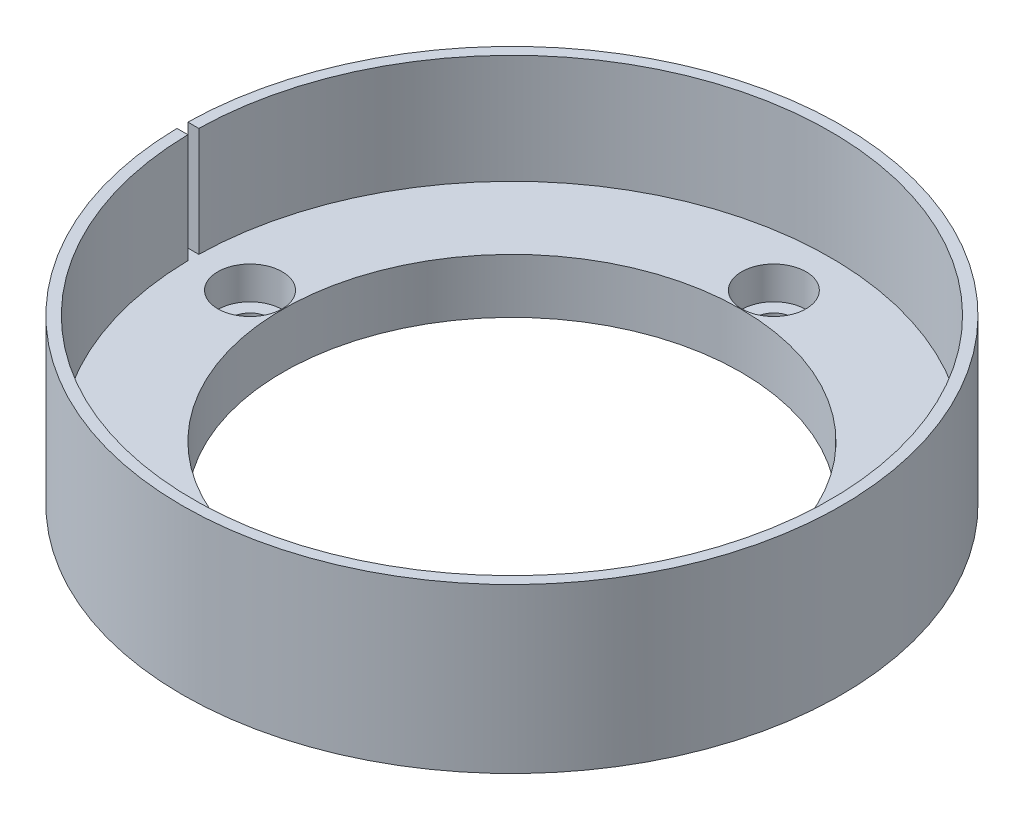
ISO-10303-21;
HEADER;
FILE_DESCRIPTION(('STEP AP214'),'2;1');
FILE_NAME('part.step','',(''),(''),'','','');
FILE_SCHEMA(('AUTOMOTIVE_DESIGN { 1 0 10303 214 1 1 1 1 }'));
ENDSEC;
DATA;
#1=APPLICATION_CONTEXT('core data for automotive mechanical design processes');
#2=APPLICATION_PROTOCOL_DEFINITION('international standard','automotive_design',2000,#1);
#3=PRODUCT_CONTEXT('',#1,'mechanical');
#4=PRODUCT('Part','Part','',(#3));
#5=PRODUCT_RELATED_PRODUCT_CATEGORY('part','',(#4));
#6=PRODUCT_DEFINITION_FORMATION('','',#4);
#7=PRODUCT_DEFINITION_CONTEXT('part definition',#1,'design');
#8=PRODUCT_DEFINITION('design','',#6,#7);
#9=PRODUCT_DEFINITION_SHAPE('','',#8);
#10=(LENGTH_UNIT() NAMED_UNIT(*) SI_UNIT(.MILLI.,.METRE.));
#11=(NAMED_UNIT(*) PLANE_ANGLE_UNIT() SI_UNIT($,.RADIAN.));
#12=(NAMED_UNIT(*) SI_UNIT($,.STERADIAN.) SOLID_ANGLE_UNIT());
#13=UNCERTAINTY_MEASURE_WITH_UNIT(LENGTH_MEASURE(1.E-05),#10,'distance_accuracy_value','');
#14=(GEOMETRIC_REPRESENTATION_CONTEXT(3) GLOBAL_UNCERTAINTY_ASSIGNED_CONTEXT((#13)) GLOBAL_UNIT_ASSIGNED_CONTEXT((#10,
#11,#12)) REPRESENTATION_CONTEXT('',''));
#15=CARTESIAN_POINT('',(0.,0.,0.));
#16=DIRECTION('',(0.,0.,1.));
#17=DIRECTION('',(1.,0.,0.));
#18=AXIS2_PLACEMENT_3D('',#15,#16,#17);
#19=CARTESIAN_POINT('',(0.,-5.,24.));
#20=DIRECTION('',(0.,1.,0.));
#21=DIRECTION('',(0.,0.,1.));
#22=AXIS2_PLACEMENT_3D('',#19,#20,#21);
#23=CYLINDRICAL_SURFACE('',#22,1.7);
#24=CARTESIAN_POINT('',(0.,0.,24.));
#25=DIRECTION('',(0.,1.,0.));
#26=DIRECTION('',(0.,0.,1.));
#27=AXIS2_PLACEMENT_3D('',#24,#25,#26);
#28=CIRCLE('',#27,1.7);
#29=CARTESIAN_POINT('',(0.,0.,25.7));
#30=VERTEX_POINT('',#29);
#31=EDGE_CURVE('E132',#30,#30,#28,.T.);
#32=ORIENTED_EDGE('',*,*,#31,.F.);
#33=EDGE_LOOP('',(#32));
#34=FACE_BOUND('',#33,.T.);
#35=CARTESIAN_POINT('',(0.,2.,24.));
#36=DIRECTION('',(0.,1.,0.));
#37=DIRECTION('',(0.,0.,1.));
#38=AXIS2_PLACEMENT_3D('',#35,#36,#37);
#39=CIRCLE('',#38,1.7);
#40=CARTESIAN_POINT('',(0.,2.,25.7));
#41=VERTEX_POINT('',#40);
#42=EDGE_CURVE('E129',#41,#41,#39,.F.);
#43=ORIENTED_EDGE('',*,*,#42,.F.);
#44=EDGE_LOOP('',(#43));
#45=FACE_BOUND('',#44,.T.);
#46=ADVANCED_FACE('F39',(#34,#45),#23,.F.);
#47=CARTESIAN_POINT('',(24.,-5.,0.));
#48=DIRECTION('',(0.,1.,0.));
#49=DIRECTION('',(0.,0.,1.));
#50=AXIS2_PLACEMENT_3D('',#47,#48,#49);
#51=CYLINDRICAL_SURFACE('',#50,1.7);
#52=CARTESIAN_POINT('',(24.,0.,0.));
#53=DIRECTION('',(0.,1.,0.));
#54=DIRECTION('',(0.,0.,1.));
#55=AXIS2_PLACEMENT_3D('',#52,#53,#54);
#56=CIRCLE('',#55,1.7);
#57=CARTESIAN_POINT('',(24.,0.,1.7));
#58=VERTEX_POINT('',#57);
#59=EDGE_CURVE('E189',#58,#58,#56,.T.);
#60=ORIENTED_EDGE('',*,*,#59,.F.);
#61=EDGE_LOOP('',(#60));
#62=FACE_BOUND('',#61,.T.);
#63=CARTESIAN_POINT('',(24.,2.,0.));
#64=DIRECTION('',(0.,1.,0.));
#65=DIRECTION('',(0.,0.,1.));
#66=AXIS2_PLACEMENT_3D('',#63,#64,#65);
#67=CIRCLE('',#66,1.7);
#68=CARTESIAN_POINT('',(24.,2.,1.7));
#69=VERTEX_POINT('',#68);
#70=EDGE_CURVE('E125',#69,#69,#67,.F.);
#71=ORIENTED_EDGE('',*,*,#70,.F.);
#72=EDGE_LOOP('',(#71));
#73=FACE_BOUND('',#72,.T.);
#74=ADVANCED_FACE('F228',(#62,#73),#51,.F.);
#75=CARTESIAN_POINT('',(0.,-5.,-24.));
#76=DIRECTION('',(0.,1.,0.));
#77=DIRECTION('',(0.,0.,1.));
#78=AXIS2_PLACEMENT_3D('',#75,#76,#77);
#79=CYLINDRICAL_SURFACE('',#78,1.7);
#80=CARTESIAN_POINT('',(0.,0.,-24.));
#81=DIRECTION('',(0.,1.,0.));
#82=DIRECTION('',(0.,0.,1.));
#83=AXIS2_PLACEMENT_3D('',#80,#81,#82);
#84=CIRCLE('',#83,1.7);
#85=CARTESIAN_POINT('',(0.,0.,-22.3));
#86=VERTEX_POINT('',#85);
#87=EDGE_CURVE('E193',#86,#86,#84,.T.);
#88=ORIENTED_EDGE('',*,*,#87,.F.);
#89=EDGE_LOOP('',(#88));
#90=FACE_BOUND('',#89,.T.);
#91=CARTESIAN_POINT('',(0.,2.,-24.));
#92=DIRECTION('',(0.,1.,0.));
#93=DIRECTION('',(0.,0.,1.));
#94=AXIS2_PLACEMENT_3D('',#91,#92,#93);
#95=CIRCLE('',#94,1.7);
#96=CARTESIAN_POINT('',(0.,2.,-22.3));
#97=VERTEX_POINT('',#96);
#98=EDGE_CURVE('E120',#97,#97,#95,.F.);
#99=ORIENTED_EDGE('',*,*,#98,.F.);
#100=EDGE_LOOP('',(#99));
#101=FACE_BOUND('',#100,.T.);
#102=ADVANCED_FACE('F234',(#90,#101),#79,.F.);
#103=CARTESIAN_POINT('',(-24.,-5.,0.));
#104=DIRECTION('',(0.,1.,0.));
#105=DIRECTION('',(0.,0.,1.));
#106=AXIS2_PLACEMENT_3D('',#103,#104,#105);
#107=CYLINDRICAL_SURFACE('',#106,1.7);
#108=CARTESIAN_POINT('',(-24.,0.,0.));
#109=DIRECTION('',(0.,1.,0.));
#110=DIRECTION('',(0.,0.,1.));
#111=AXIS2_PLACEMENT_3D('',#108,#109,#110);
#112=CIRCLE('',#111,1.7);
#113=CARTESIAN_POINT('',(-24.,0.,1.7));
#114=VERTEX_POINT('',#113);
#115=EDGE_CURVE('E197',#114,#114,#112,.T.);
#116=ORIENTED_EDGE('',*,*,#115,.F.);
#117=EDGE_LOOP('',(#116));
#118=FACE_BOUND('',#117,.T.);
#119=CARTESIAN_POINT('',(-24.,2.,0.));
#120=DIRECTION('',(0.,1.,0.));
#121=DIRECTION('',(0.,0.,1.));
#122=AXIS2_PLACEMENT_3D('',#119,#120,#121);
#123=CIRCLE('',#122,1.7);
#124=CARTESIAN_POINT('',(-24.,2.,1.7));
#125=VERTEX_POINT('',#124);
#126=EDGE_CURVE('E116',#125,#125,#123,.F.);
#127=ORIENTED_EDGE('',*,*,#126,.F.);
#128=EDGE_LOOP('',(#127));
#129=FACE_BOUND('',#128,.T.);
#130=ADVANCED_FACE('F211',(#118,#129),#107,.F.);
#131=CARTESIAN_POINT('',(30.2,0.,0.));
#132=DIRECTION('',(0.,1.,0.));
#133=DIRECTION('',(0.,0.,1.));
#134=AXIS2_PLACEMENT_3D('',#131,#132,#133);
#135=PLANE('',#134);
#136=ORIENTED_EDGE('',*,*,#115,.T.);
#137=EDGE_LOOP('',(#136));
#138=FACE_BOUND('',#137,.T.);
#139=ORIENTED_EDGE('',*,*,#87,.T.);
#140=EDGE_LOOP('',(#139));
#141=FACE_BOUND('',#140,.T.);
#142=ORIENTED_EDGE('',*,*,#59,.T.);
#143=EDGE_LOOP('',(#142));
#144=FACE_BOUND('',#143,.T.);
#145=ORIENTED_EDGE('',*,*,#31,.T.);
#146=EDGE_LOOP('',(#145));
#147=FACE_BOUND('',#146,.T.);
#148=CARTESIAN_POINT('',(0.,0.,0.));
#149=DIRECTION('',(0.,1.,0.));
#150=DIRECTION('',(0.,0.,1.));
#151=AXIS2_PLACEMENT_3D('',#148,#149,#150);
#152=CIRCLE('',#151,30.2);
#153=CARTESIAN_POINT('',(0.,0.,30.2));
#154=VERTEX_POINT('',#153);
#155=EDGE_CURVE('E201',#154,#154,#152,.T.);
#156=ORIENTED_EDGE('',*,*,#155,.F.);
#157=EDGE_LOOP('',(#156));
#158=FACE_BOUND('',#157,.T.);
#159=CARTESIAN_POINT('',(0.,0.,0.));
#160=DIRECTION('',(0.,1.,0.));
#161=DIRECTION('',(0.,0.,1.));
#162=AXIS2_PLACEMENT_3D('',#159,#160,#161);
#163=CIRCLE('',#162,21.);
#164=CARTESIAN_POINT('',(0.,0.,21.));
#165=VERTEX_POINT('',#164);
#166=EDGE_CURVE('E107',#165,#165,#163,.T.);
#167=ORIENTED_EDGE('',*,*,#166,.T.);
#168=EDGE_LOOP('',(#167));
#169=FACE_BOUND('',#168,.T.);
#170=ADVANCED_FACE('F41',(#138,#141,#144,#147,#158,#169),#135,.F.);
#171=CARTESIAN_POINT('',(0.,26.8169522665698,0.));
#172=DIRECTION('',(0.,1.,0.));
#173=DIRECTION('',(0.,0.,1.));
#174=AXIS2_PLACEMENT_3D('',#171,#172,#173);
#175=CYLINDRICAL_SURFACE('',#174,21.);
#176=ORIENTED_EDGE('',*,*,#166,.F.);
#177=EDGE_LOOP('',(#176));
#178=FACE_BOUND('',#177,.T.);
#179=CARTESIAN_POINT('',(0.,5.,0.));
#180=DIRECTION('',(0.,1.,0.));
#181=DIRECTION('',(0.,0.,1.));
#182=AXIS2_PLACEMENT_3D('',#179,#180,#181);
#183=CIRCLE('',#182,21.);
#184=CARTESIAN_POINT('',(0.,5.,21.));
#185=VERTEX_POINT('',#184);
#186=EDGE_CURVE('E102',#185,#185,#183,.T.);
#187=ORIENTED_EDGE('',*,*,#186,.T.);
#188=EDGE_LOOP('',(#187));
#189=FACE_BOUND('',#188,.T.);
#190=ADVANCED_FACE('F210',(#178,#189),#175,.F.);
#191=CARTESIAN_POINT('',(21.,5.,0.));
#192=DIRECTION('',(0.,-1.,0.));
#193=DIRECTION('',(0.,0.,-1.));
#194=AXIS2_PLACEMENT_3D('',#191,#192,#193);
#195=PLANE('',#194);
#196=CARTESIAN_POINT('',(-24.,5.,0.));
#197=DIRECTION('',(0.,1.,0.));
#198=DIRECTION('',(0.,0.,1.));
#199=AXIS2_PLACEMENT_3D('',#196,#197,#198);
#200=CIRCLE('',#199,2.95);
#201=CARTESIAN_POINT('',(-24.,5.,2.95));
#202=VERTEX_POINT('',#201);
#203=EDGE_CURVE('E159',#202,#202,#200,.T.);
#204=ORIENTED_EDGE('',*,*,#203,.F.);
#205=EDGE_LOOP('',(#204));
#206=FACE_BOUND('',#205,.T.);
#207=CARTESIAN_POINT('',(0.,5.,0.));
#208=DIRECTION('',(0.,1.,0.));
#209=DIRECTION('',(0.,0.,1.));
#210=AXIS2_PLACEMENT_3D('',#207,#208,#209);
#211=CIRCLE('',#210,29.2);
#212=CARTESIAN_POINT('',(-29.1957188642445,5.,0.5));
#213=VERTEX_POINT('',#212);
#214=CARTESIAN_POINT('',(-29.1957188642445,5.,-0.5));
#215=VERTEX_POINT('',#214);
#216=EDGE_CURVE('E90',#213,#215,#211,.T.);
#217=ORIENTED_EDGE('',*,*,#216,.T.);
#218=DIRECTION('',(-1.,0.,0.));
#219=VECTOR('',#218,1.);
#220=CARTESIAN_POINT('',(-24.2,5.,-0.500000000000001));
#221=LINE('',#220,#219);
#222=CARTESIAN_POINT('',(-30.1958606434723,5.,-0.5));
#223=VERTEX_POINT('',#222);
#224=EDGE_CURVE('E55',#215,#223,#221,.T.);
#225=ORIENTED_EDGE('',*,*,#224,.T.);
#226=CARTESIAN_POINT('',(0.,5.,0.));
#227=DIRECTION('',(0.,1.,0.));
#228=DIRECTION('',(0.,0.,1.));
#229=AXIS2_PLACEMENT_3D('',#226,#227,#228);
#230=CIRCLE('',#229,30.2);
#231=CARTESIAN_POINT('',(-30.1958606434723,5.,0.5));
#232=VERTEX_POINT('',#231);
#233=EDGE_CURVE('E82',#223,#232,#230,.T.);
#234=ORIENTED_EDGE('',*,*,#233,.T.);
#235=DIRECTION('',(1.,0.,0.));
#236=VECTOR('',#235,1.);
#237=CARTESIAN_POINT('',(-24.2,5.,0.499999999999999));
#238=LINE('',#237,#236);
#239=EDGE_CURVE('E83',#232,#213,#238,.T.);
#240=ORIENTED_EDGE('',*,*,#239,.T.);
#241=EDGE_LOOP('',(#217,#225,#234,#240));
#242=FACE_BOUND('',#241,.T.);
#243=CARTESIAN_POINT('',(0.,5.,-24.));
#244=DIRECTION('',(0.,1.,0.));
#245=DIRECTION('',(0.,0.,1.));
#246=AXIS2_PLACEMENT_3D('',#243,#244,#245);
#247=CIRCLE('',#246,2.95);
#248=CARTESIAN_POINT('',(0.,5.,-21.05));
#249=VERTEX_POINT('',#248);
#250=EDGE_CURVE('E167',#249,#249,#247,.T.);
#251=ORIENTED_EDGE('',*,*,#250,.F.);
#252=EDGE_LOOP('',(#251));
#253=FACE_BOUND('',#252,.T.);
#254=CARTESIAN_POINT('',(24.,5.,0.));
#255=DIRECTION('',(0.,1.,0.));
#256=DIRECTION('',(0.,0.,1.));
#257=AXIS2_PLACEMENT_3D('',#254,#255,#256);
#258=CIRCLE('',#257,2.95);
#259=CARTESIAN_POINT('',(24.,5.,2.95));
#260=VERTEX_POINT('',#259);
#261=EDGE_CURVE('E175',#260,#260,#258,.T.);
#262=ORIENTED_EDGE('',*,*,#261,.F.);
#263=EDGE_LOOP('',(#262));
#264=FACE_BOUND('',#263,.T.);
#265=CARTESIAN_POINT('',(0.,5.,24.));
#266=DIRECTION('',(0.,1.,0.));
#267=DIRECTION('',(0.,0.,1.));
#268=AXIS2_PLACEMENT_3D('',#265,#266,#267);
#269=CIRCLE('',#268,2.95);
#270=CARTESIAN_POINT('',(0.,5.,26.95));
#271=VERTEX_POINT('',#270);
#272=EDGE_CURVE('E94',#271,#271,#269,.T.);
#273=ORIENTED_EDGE('',*,*,#272,.F.);
#274=EDGE_LOOP('',(#273));
#275=FACE_BOUND('',#274,.T.);
#276=ORIENTED_EDGE('',*,*,#186,.F.);
#277=EDGE_LOOP('',(#276));
#278=FACE_BOUND('',#277,.T.);
#279=ADVANCED_FACE('F98',(#206,#242,#253,#264,#275,#278),#195,.F.);
#280=CARTESIAN_POINT('',(0.,26.8169522665698,0.));
#281=DIRECTION('',(0.,1.,0.));
#282=DIRECTION('',(0.,0.,1.));
#283=AXIS2_PLACEMENT_3D('',#280,#281,#282);
#284=CYLINDRICAL_SURFACE('',#283,29.2);
#285=CARTESIAN_POINT('',(0.,15.,0.));
#286=DIRECTION('',(0.,1.,0.));
#287=DIRECTION('',(0.,0.,1.));
#288=AXIS2_PLACEMENT_3D('',#285,#286,#287);
#289=CIRCLE('',#288,29.2);
#290=CARTESIAN_POINT('',(-29.1957188642445,15.,0.5));
#291=VERTEX_POINT('',#290);
#292=CARTESIAN_POINT('',(-29.1957188642445,15.,-0.5));
#293=VERTEX_POINT('',#292);
#294=EDGE_CURVE('E92',#291,#293,#289,.T.);
#295=ORIENTED_EDGE('',*,*,#294,.T.);
#296=DIRECTION('',(0.,1.,0.));
#297=VECTOR('',#296,1.);
#298=CARTESIAN_POINT('',(-29.1957188642445,26.8169522665698,-0.5));
#299=LINE('',#298,#297);
#300=EDGE_CURVE('E79',#293,#215,#299,.F.);
#301=ORIENTED_EDGE('',*,*,#300,.T.);
#302=ORIENTED_EDGE('',*,*,#216,.F.);
#303=DIRECTION('',(0.,1.,0.));
#304=VECTOR('',#303,1.);
#305=CARTESIAN_POINT('',(-29.1957188642445,26.8169522665698,0.5));
#306=LINE('',#305,#304);
#307=EDGE_CURVE('E95',#213,#291,#306,.T.);
#308=ORIENTED_EDGE('',*,*,#307,.T.);
#309=EDGE_LOOP('',(#295,#301,#302,#308));
#310=FACE_BOUND('',#309,.T.);
#311=ADVANCED_FACE('F88',(#310),#284,.F.);
#312=CARTESIAN_POINT('',(29.2,15.,0.));
#313=DIRECTION('',(0.,-1.,0.));
#314=DIRECTION('',(0.,0.,-1.));
#315=AXIS2_PLACEMENT_3D('',#312,#313,#314);
#316=PLANE('',#315);
#317=CARTESIAN_POINT('',(0.,15.,0.));
#318=DIRECTION('',(0.,1.,0.));
#319=DIRECTION('',(0.,0.,1.));
#320=AXIS2_PLACEMENT_3D('',#317,#318,#319);
#321=CIRCLE('',#320,30.2);
#322=CARTESIAN_POINT('',(-30.1958606434723,15.,0.5));
#323=VERTEX_POINT('',#322);
#324=CARTESIAN_POINT('',(-30.1958606434723,15.,-0.5));
#325=VERTEX_POINT('',#324);
#326=EDGE_CURVE('E109',#323,#325,#321,.T.);
#327=ORIENTED_EDGE('',*,*,#326,.T.);
#328=DIRECTION('',(-1.,0.,0.));
#329=VECTOR('',#328,1.);
#330=CARTESIAN_POINT('',(-24.2,15.,-0.500000000000001));
#331=LINE('',#330,#329);
#332=EDGE_CURVE('E62',#293,#325,#331,.T.);
#333=ORIENTED_EDGE('',*,*,#332,.F.);
#334=ORIENTED_EDGE('',*,*,#294,.F.);
#335=DIRECTION('',(1.,0.,0.));
#336=VECTOR('',#335,1.);
#337=CARTESIAN_POINT('',(-24.2,15.,0.499999999999999));
#338=LINE('',#337,#336);
#339=EDGE_CURVE('E143',#323,#291,#338,.T.);
#340=ORIENTED_EDGE('',*,*,#339,.F.);
#341=EDGE_LOOP('',(#327,#333,#334,#340));
#342=FACE_BOUND('',#341,.T.);
#343=ADVANCED_FACE('F145',(#342),#316,.F.);
#344=CARTESIAN_POINT('',(0.,26.8169522665698,0.));
#345=DIRECTION('',(0.,1.,0.));
#346=DIRECTION('',(0.,0.,1.));
#347=AXIS2_PLACEMENT_3D('',#344,#345,#346);
#348=CYLINDRICAL_SURFACE('',#347,30.2);
#349=ORIENTED_EDGE('',*,*,#233,.F.);
#350=DIRECTION('',(0.,1.,0.));
#351=VECTOR('',#350,1.);
#352=CARTESIAN_POINT('',(-30.1958606434723,26.8169522665698,-0.5));
#353=LINE('',#352,#351);
#354=EDGE_CURVE('E11',#223,#325,#353,.T.);
#355=ORIENTED_EDGE('',*,*,#354,.T.);
#356=ORIENTED_EDGE('',*,*,#326,.F.);
#357=DIRECTION('',(0.,1.,0.));
#358=VECTOR('',#357,1.);
#359=CARTESIAN_POINT('',(-30.1958606434723,26.8169522665698,0.5));
#360=LINE('',#359,#358);
#361=EDGE_CURVE('E48',#323,#232,#360,.F.);
#362=ORIENTED_EDGE('',*,*,#361,.T.);
#363=EDGE_LOOP('',(#349,#355,#356,#362));
#364=FACE_BOUND('',#363,.T.);
#365=ORIENTED_EDGE('',*,*,#155,.T.);
#366=EDGE_LOOP('',(#365));
#367=FACE_BOUND('',#366,.T.);
#368=ADVANCED_FACE('F137',(#364,#367),#348,.T.);
#369=CARTESIAN_POINT('',(-24.,2.,0.));
#370=DIRECTION('',(0.,1.,0.));
#371=DIRECTION('',(0.,0.,1.));
#372=AXIS2_PLACEMENT_3D('',#369,#370,#371);
#373=PLANE('',#372);
#374=CARTESIAN_POINT('',(-24.,2.,0.));
#375=DIRECTION('',(0.,1.,0.));
#376=DIRECTION('',(0.,0.,1.));
#377=AXIS2_PLACEMENT_3D('',#374,#375,#376);
#378=CIRCLE('',#377,2.95);
#379=CARTESIAN_POINT('',(-24.,2.,2.95));
#380=VERTEX_POINT('',#379);
#381=EDGE_CURVE('E121',#380,#380,#378,.T.);
#382=ORIENTED_EDGE('',*,*,#381,.T.);
#383=EDGE_LOOP('',(#382));
#384=FACE_BOUND('',#383,.T.);
#385=ORIENTED_EDGE('',*,*,#126,.T.);
#386=EDGE_LOOP('',(#385));
#387=FACE_BOUND('',#386,.T.);
#388=ADVANCED_FACE('F243',(#384,#387),#373,.T.);
#389=CARTESIAN_POINT('',(-24.,2.,0.));
#390=DIRECTION('',(0.,1.,0.));
#391=DIRECTION('',(0.,0.,1.));
#392=AXIS2_PLACEMENT_3D('',#389,#390,#391);
#393=CYLINDRICAL_SURFACE('',#392,2.95);
#394=ORIENTED_EDGE('',*,*,#381,.F.);
#395=EDGE_LOOP('',(#394));
#396=FACE_BOUND('',#395,.T.);
#397=ORIENTED_EDGE('',*,*,#203,.T.);
#398=EDGE_LOOP('',(#397));
#399=FACE_BOUND('',#398,.T.);
#400=ADVANCED_FACE('F260',(#396,#399),#393,.F.);
#401=CARTESIAN_POINT('',(0.,2.,-24.));
#402=DIRECTION('',(0.,1.,0.));
#403=DIRECTION('',(0.,0.,1.));
#404=AXIS2_PLACEMENT_3D('',#401,#402,#403);
#405=PLANE('',#404);
#406=CARTESIAN_POINT('',(0.,2.,-24.));
#407=DIRECTION('',(0.,1.,0.));
#408=DIRECTION('',(0.,0.,1.));
#409=AXIS2_PLACEMENT_3D('',#406,#407,#408);
#410=CIRCLE('',#409,2.95);
#411=CARTESIAN_POINT('',(0.,2.,-21.05));
#412=VERTEX_POINT('',#411);
#413=EDGE_CURVE('E163',#412,#412,#410,.T.);
#414=ORIENTED_EDGE('',*,*,#413,.T.);
#415=EDGE_LOOP('',(#414));
#416=FACE_BOUND('',#415,.T.);
#417=ORIENTED_EDGE('',*,*,#98,.T.);
#418=EDGE_LOOP('',(#417));
#419=FACE_BOUND('',#418,.T.);
#420=ADVANCED_FACE('F269',(#416,#419),#405,.T.);
#421=CARTESIAN_POINT('',(0.,2.,-24.));
#422=DIRECTION('',(0.,1.,0.));
#423=DIRECTION('',(0.,0.,1.));
#424=AXIS2_PLACEMENT_3D('',#421,#422,#423);
#425=CYLINDRICAL_SURFACE('',#424,2.95);
#426=ORIENTED_EDGE('',*,*,#413,.F.);
#427=EDGE_LOOP('',(#426));
#428=FACE_BOUND('',#427,.T.);
#429=ORIENTED_EDGE('',*,*,#250,.T.);
#430=EDGE_LOOP('',(#429));
#431=FACE_BOUND('',#430,.T.);
#432=ADVANCED_FACE('F277',(#428,#431),#425,.F.);
#433=CARTESIAN_POINT('',(24.,2.,0.));
#434=DIRECTION('',(0.,1.,0.));
#435=DIRECTION('',(0.,0.,1.));
#436=AXIS2_PLACEMENT_3D('',#433,#434,#435);
#437=PLANE('',#436);
#438=CARTESIAN_POINT('',(24.,2.,0.));
#439=DIRECTION('',(0.,1.,0.));
#440=DIRECTION('',(0.,0.,1.));
#441=AXIS2_PLACEMENT_3D('',#438,#439,#440);
#442=CIRCLE('',#441,2.95);
#443=CARTESIAN_POINT('',(24.,2.,2.95));
#444=VERTEX_POINT('',#443);
#445=EDGE_CURVE('E171',#444,#444,#442,.T.);
#446=ORIENTED_EDGE('',*,*,#445,.T.);
#447=EDGE_LOOP('',(#446));
#448=FACE_BOUND('',#447,.T.);
#449=ORIENTED_EDGE('',*,*,#70,.T.);
#450=EDGE_LOOP('',(#449));
#451=FACE_BOUND('',#450,.T.);
#452=ADVANCED_FACE('F285',(#448,#451),#437,.T.);
#453=CARTESIAN_POINT('',(24.,2.,0.));
#454=DIRECTION('',(0.,1.,0.));
#455=DIRECTION('',(0.,0.,1.));
#456=AXIS2_PLACEMENT_3D('',#453,#454,#455);
#457=CYLINDRICAL_SURFACE('',#456,2.95);
#458=ORIENTED_EDGE('',*,*,#445,.F.);
#459=EDGE_LOOP('',(#458));
#460=FACE_BOUND('',#459,.T.);
#461=ORIENTED_EDGE('',*,*,#261,.T.);
#462=EDGE_LOOP('',(#461));
#463=FACE_BOUND('',#462,.T.);
#464=ADVANCED_FACE('F293',(#460,#463),#457,.F.);
#465=CARTESIAN_POINT('',(0.,2.,24.));
#466=DIRECTION('',(0.,1.,0.));
#467=DIRECTION('',(0.,0.,1.));
#468=AXIS2_PLACEMENT_3D('',#465,#466,#467);
#469=PLANE('',#468);
#470=CARTESIAN_POINT('',(0.,2.,24.));
#471=DIRECTION('',(0.,1.,0.));
#472=DIRECTION('',(0.,0.,1.));
#473=AXIS2_PLACEMENT_3D('',#470,#471,#472);
#474=CIRCLE('',#473,2.95);
#475=CARTESIAN_POINT('',(0.,2.,26.95));
#476=VERTEX_POINT('',#475);
#477=EDGE_CURVE('E179',#476,#476,#474,.T.);
#478=ORIENTED_EDGE('',*,*,#477,.T.);
#479=EDGE_LOOP('',(#478));
#480=FACE_BOUND('',#479,.T.);
#481=ORIENTED_EDGE('',*,*,#42,.T.);
#482=EDGE_LOOP('',(#481));
#483=FACE_BOUND('',#482,.T.);
#484=ADVANCED_FACE('F301',(#480,#483),#469,.T.);
#485=CARTESIAN_POINT('',(0.,2.,24.));
#486=DIRECTION('',(0.,1.,0.));
#487=DIRECTION('',(0.,0.,1.));
#488=AXIS2_PLACEMENT_3D('',#485,#486,#487);
#489=CYLINDRICAL_SURFACE('',#488,2.95);
#490=ORIENTED_EDGE('',*,*,#477,.F.);
#491=EDGE_LOOP('',(#490));
#492=FACE_BOUND('',#491,.T.);
#493=ORIENTED_EDGE('',*,*,#272,.T.);
#494=EDGE_LOOP('',(#493));
#495=FACE_BOUND('',#494,.T.);
#496=ADVANCED_FACE('F309',(#492,#495),#489,.F.);
#497=CARTESIAN_POINT('',(-24.2,5.,-0.500000000000001));
#498=DIRECTION('',(0.,0.,-1.));
#499=DIRECTION('',(-1.,0.,0.));
#500=AXIS2_PLACEMENT_3D('',#497,#498,#499);
#501=PLANE('',#500);
#502=ORIENTED_EDGE('',*,*,#332,.T.);
#503=ORIENTED_EDGE('',*,*,#354,.F.);
#504=ORIENTED_EDGE('',*,*,#224,.F.);
#505=ORIENTED_EDGE('',*,*,#300,.F.);
#506=EDGE_LOOP('',(#502,#503,#504,#505));
#507=FACE_BOUND('',#506,.T.);
#508=ADVANCED_FACE('F78',(#507),#501,.F.);
#509=CARTESIAN_POINT('',(-24.2,5.,0.499999999999999));
#510=DIRECTION('',(0.,0.,1.));
#511=DIRECTION('',(1.,0.,0.));
#512=AXIS2_PLACEMENT_3D('',#509,#510,#511);
#513=PLANE('',#512);
#514=ORIENTED_EDGE('',*,*,#239,.F.);
#515=ORIENTED_EDGE('',*,*,#361,.F.);
#516=ORIENTED_EDGE('',*,*,#339,.T.);
#517=ORIENTED_EDGE('',*,*,#307,.F.);
#518=EDGE_LOOP('',(#514,#515,#516,#517));
#519=FACE_BOUND('',#518,.T.);
#520=ADVANCED_FACE('F142',(#519),#513,.F.);
#521=CLOSED_SHELL('',(#46,#74,#102,#130,#170,#190,#279,#311,#343,#368,#388,#400,#420,#432,#452,
#464,#484,#496,#508,#520));
#522=MANIFOLD_SOLID_BREP('B2',#521);
#523=ADVANCED_BREP_SHAPE_REPRESENTATION('',(#18,#522),#14);
#524=SHAPE_DEFINITION_REPRESENTATION(#9,#523);
ENDSEC;
END-ISO-10303-21;
